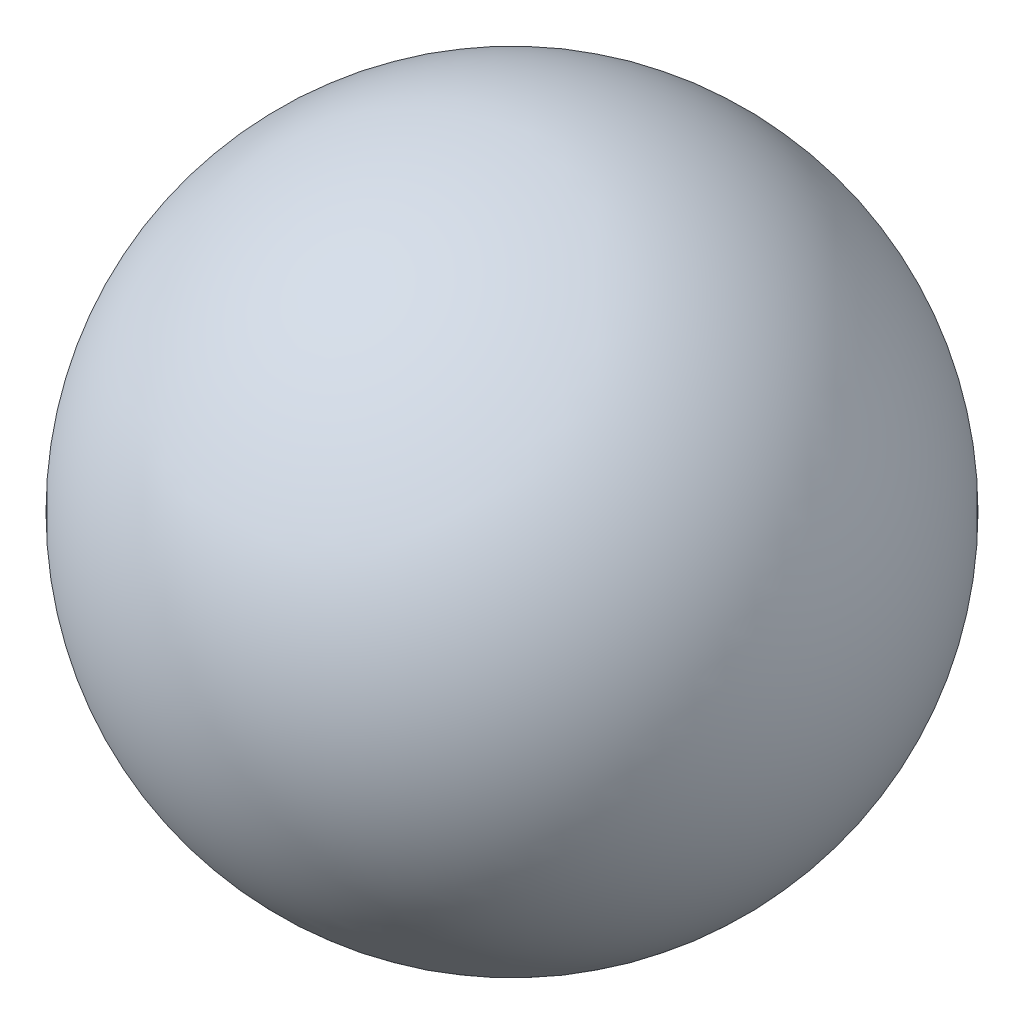
ISO-10303-21;
HEADER;
FILE_DESCRIPTION(('STEP AP214'),'2;1');
FILE_NAME('part.step','',(''),(''),'','','');
FILE_SCHEMA(('AUTOMOTIVE_DESIGN { 1 0 10303 214 1 1 1 1 }'));
ENDSEC;
DATA;
#1=APPLICATION_CONTEXT('core data for automotive mechanical design processes');
#2=APPLICATION_PROTOCOL_DEFINITION('international standard','automotive_design',2000,#1);
#3=PRODUCT_CONTEXT('',#1,'mechanical');
#4=PRODUCT('Part','Part','',(#3));
#5=PRODUCT_RELATED_PRODUCT_CATEGORY('part','',(#4));
#6=PRODUCT_DEFINITION_FORMATION('','',#4);
#7=PRODUCT_DEFINITION_CONTEXT('part definition',#1,'design');
#8=PRODUCT_DEFINITION('design','',#6,#7);
#9=PRODUCT_DEFINITION_SHAPE('','',#8);
#10=(LENGTH_UNIT() NAMED_UNIT(*) SI_UNIT(.MILLI.,.METRE.));
#11=(NAMED_UNIT(*) PLANE_ANGLE_UNIT() SI_UNIT($,.RADIAN.));
#12=(NAMED_UNIT(*) SI_UNIT($,.STERADIAN.) SOLID_ANGLE_UNIT());
#13=UNCERTAINTY_MEASURE_WITH_UNIT(LENGTH_MEASURE(1.E-05),#10,'distance_accuracy_value','');
#14=(GEOMETRIC_REPRESENTATION_CONTEXT(3) GLOBAL_UNCERTAINTY_ASSIGNED_CONTEXT((#13)) GLOBAL_UNIT_ASSIGNED_CONTEXT((#10,
#11,#12)) REPRESENTATION_CONTEXT('',''));
#15=CARTESIAN_POINT('',(0.,0.,0.));
#16=DIRECTION('',(0.,0.,1.));
#17=DIRECTION('',(1.,0.,0.));
#18=AXIS2_PLACEMENT_3D('',#15,#16,#17);
#19=CARTESIAN_POINT('',(0.,0.,0.));
#20=DIRECTION('',(-0.707106781186546,0.,0.707106781186549));
#21=DIRECTION('',(-0.707106781186549,0.,-0.707106781186546));
#22=AXIS2_PLACEMENT_3D('',#19,#20,#21);
#23=SPHERICAL_SURFACE('',#22,21.336);
#24=CARTESIAN_POINT('',(-15.0868302833962,0.,15.0868302833962));
#25=VERTEX_POINT('',#24);
#26=VERTEX_LOOP('',#25);
#27=FACE_BOUND('',#26,.T.);
#28=ADVANCED_FACE('F29',(#27),#23,.T.);
#29=CLOSED_SHELL('',(#28));
#30=MANIFOLD_SOLID_BREP('B2',#29);
#31=ADVANCED_BREP_SHAPE_REPRESENTATION('',(#18,#30),#14);
#32=SHAPE_DEFINITION_REPRESENTATION(#9,#31);
ENDSEC;
END-ISO-10303-21;
